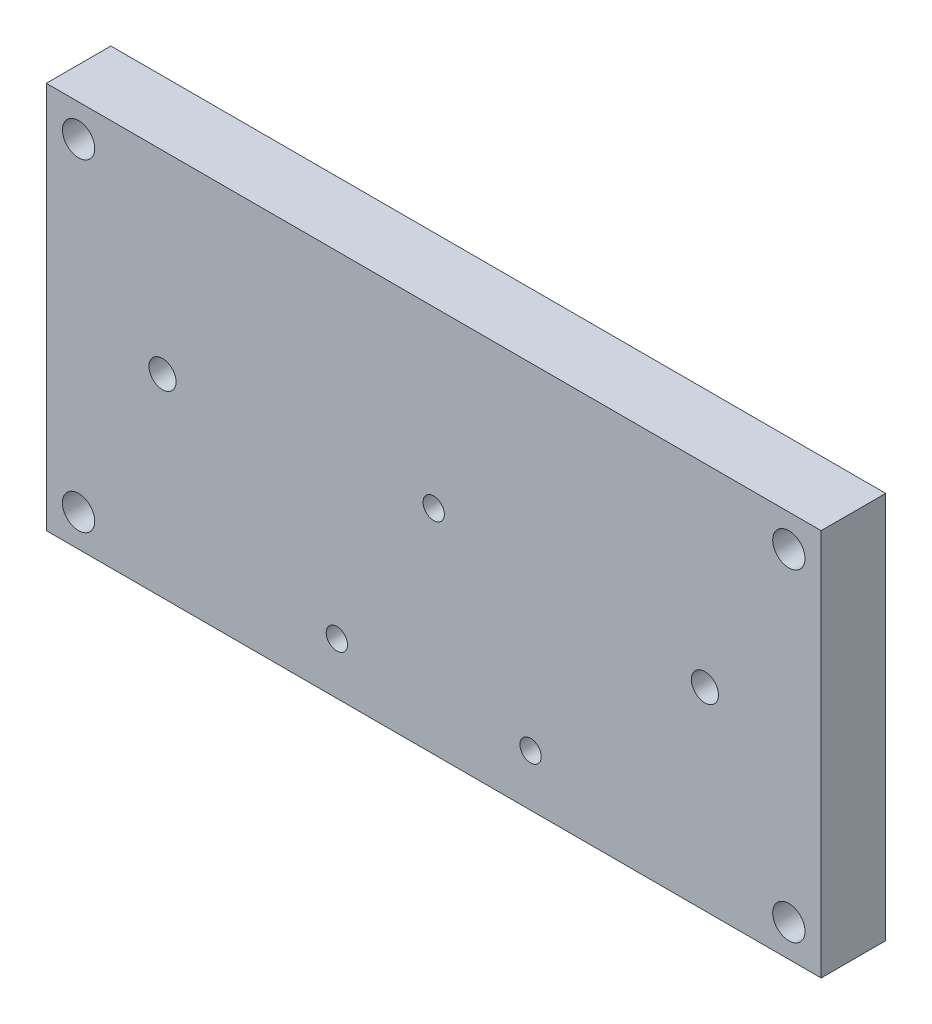
ISO-10303-21;
HEADER;
FILE_DESCRIPTION(('STEP AP214'),'2;1');
FILE_NAME('part.step','',(''),(''),'','','');
FILE_SCHEMA(('AUTOMOTIVE_DESIGN { 1 0 10303 214 1 1 1 1 }'));
ENDSEC;
DATA;
#1=APPLICATION_CONTEXT('core data for automotive mechanical design processes');
#2=APPLICATION_PROTOCOL_DEFINITION('international standard','automotive_design',2000,#1);
#3=PRODUCT_CONTEXT('',#1,'mechanical');
#4=PRODUCT('Part','Part','',(#3));
#5=PRODUCT_RELATED_PRODUCT_CATEGORY('part','',(#4));
#6=PRODUCT_DEFINITION_FORMATION('','',#4);
#7=PRODUCT_DEFINITION_CONTEXT('part definition',#1,'design');
#8=PRODUCT_DEFINITION('design','',#6,#7);
#9=PRODUCT_DEFINITION_SHAPE('','',#8);
#10=(LENGTH_UNIT() NAMED_UNIT(*) SI_UNIT(.MILLI.,.METRE.));
#11=(NAMED_UNIT(*) PLANE_ANGLE_UNIT() SI_UNIT($,.RADIAN.));
#12=(NAMED_UNIT(*) SI_UNIT($,.STERADIAN.) SOLID_ANGLE_UNIT());
#13=UNCERTAINTY_MEASURE_WITH_UNIT(LENGTH_MEASURE(1.E-05),#10,'distance_accuracy_value','');
#14=(GEOMETRIC_REPRESENTATION_CONTEXT(3) GLOBAL_UNCERTAINTY_ASSIGNED_CONTEXT((#13)) GLOBAL_UNIT_ASSIGNED_CONTEXT((#10,
#11,#12)) REPRESENTATION_CONTEXT('',''));
#15=CARTESIAN_POINT('',(0.,0.,0.));
#16=DIRECTION('',(0.,0.,1.));
#17=DIRECTION('',(1.,0.,0.));
#18=AXIS2_PLACEMENT_3D('',#15,#16,#17);
#19=CARTESIAN_POINT('',(60.,30.,10.));
#20=DIRECTION('',(-1.,0.,0.));
#21=DIRECTION('',(0.,-1.,0.));
#22=AXIS2_PLACEMENT_3D('',#19,#20,#21);
#23=PLANE('',#22);
#24=DIRECTION('',(0.,1.,0.));
#25=VECTOR('',#24,1.);
#26=CARTESIAN_POINT('',(60.,30.,0.));
#27=LINE('',#26,#25);
#28=CARTESIAN_POINT('',(60.,-30.,0.));
#29=VERTEX_POINT('',#28);
#30=CARTESIAN_POINT('',(60.,30.,0.));
#31=VERTEX_POINT('',#30);
#32=EDGE_CURVE('E100',#29,#31,#27,.T.);
#33=ORIENTED_EDGE('',*,*,#32,.T.);
#34=DIRECTION('',(0.,0.,-1.));
#35=VECTOR('',#34,1.);
#36=CARTESIAN_POINT('',(60.,30.,10.));
#37=LINE('',#36,#35);
#38=CARTESIAN_POINT('',(60.,30.,10.));
#39=VERTEX_POINT('',#38);
#40=EDGE_CURVE('E11',#39,#31,#37,.T.);
#41=ORIENTED_EDGE('',*,*,#40,.F.);
#42=DIRECTION('',(0.,1.,0.));
#43=VECTOR('',#42,1.);
#44=CARTESIAN_POINT('',(60.,30.,10.));
#45=LINE('',#44,#43);
#46=CARTESIAN_POINT('',(60.,-30.,10.));
#47=VERTEX_POINT('',#46);
#48=EDGE_CURVE('E88',#47,#39,#45,.T.);
#49=ORIENTED_EDGE('',*,*,#48,.F.);
#50=DIRECTION('',(0.,0.,-1.));
#51=VECTOR('',#50,1.);
#52=CARTESIAN_POINT('',(60.,-30.,10.));
#53=LINE('',#52,#51);
#54=EDGE_CURVE('E96',#47,#29,#53,.T.);
#55=ORIENTED_EDGE('',*,*,#54,.T.);
#56=EDGE_LOOP('',(#33,#41,#49,#55));
#57=FACE_BOUND('',#56,.T.);
#58=ADVANCED_FACE('F37',(#57),#23,.F.);
#59=CARTESIAN_POINT('',(-60.,30.,10.));
#60=DIRECTION('',(0.,-1.,0.));
#61=DIRECTION('',(0.,0.,-1.));
#62=AXIS2_PLACEMENT_3D('',#59,#60,#61);
#63=PLANE('',#62);
#64=DIRECTION('',(-1.,0.,0.));
#65=VECTOR('',#64,1.);
#66=CARTESIAN_POINT('',(-60.,30.,0.));
#67=LINE('',#66,#65);
#68=CARTESIAN_POINT('',(-60.,30.,0.));
#69=VERTEX_POINT('',#68);
#70=EDGE_CURVE('E92',#31,#69,#67,.T.);
#71=ORIENTED_EDGE('',*,*,#70,.T.);
#72=DIRECTION('',(0.,0.,-1.));
#73=VECTOR('',#72,1.);
#74=CARTESIAN_POINT('',(-60.,30.,10.));
#75=LINE('',#74,#73);
#76=CARTESIAN_POINT('',(-60.,30.,10.));
#77=VERTEX_POINT('',#76);
#78=EDGE_CURVE('E45',#77,#69,#75,.T.);
#79=ORIENTED_EDGE('',*,*,#78,.F.);
#80=DIRECTION('',(-1.,0.,0.));
#81=VECTOR('',#80,1.);
#82=CARTESIAN_POINT('',(-60.,30.,10.));
#83=LINE('',#82,#81);
#84=EDGE_CURVE('E83',#39,#77,#83,.T.);
#85=ORIENTED_EDGE('',*,*,#84,.F.);
#86=ORIENTED_EDGE('',*,*,#40,.T.);
#87=EDGE_LOOP('',(#71,#79,#85,#86));
#88=FACE_BOUND('',#87,.T.);
#89=ADVANCED_FACE('F91',(#88),#63,.F.);
#90=CARTESIAN_POINT('',(-60.,30.,10.));
#91=DIRECTION('',(1.,0.,0.));
#92=DIRECTION('',(0.,0.,-1.));
#93=AXIS2_PLACEMENT_3D('',#90,#91,#92);
#94=PLANE('',#93);
#95=DIRECTION('',(0.,-1.,0.));
#96=VECTOR('',#95,1.);
#97=CARTESIAN_POINT('',(-60.,30.,0.));
#98=LINE('',#97,#96);
#99=CARTESIAN_POINT('',(-60.,-30.,0.));
#100=VERTEX_POINT('',#99);
#101=EDGE_CURVE('E70',#69,#100,#98,.T.);
#102=ORIENTED_EDGE('',*,*,#101,.T.);
#103=DIRECTION('',(0.,0.,-1.));
#104=VECTOR('',#103,1.);
#105=CARTESIAN_POINT('',(-60.,-30.,10.));
#106=LINE('',#105,#104);
#107=CARTESIAN_POINT('',(-60.,-30.,10.));
#108=VERTEX_POINT('',#107);
#109=EDGE_CURVE('E93',#108,#100,#106,.T.);
#110=ORIENTED_EDGE('',*,*,#109,.F.);
#111=DIRECTION('',(0.,-1.,0.));
#112=VECTOR('',#111,1.);
#113=CARTESIAN_POINT('',(-60.,30.,10.));
#114=LINE('',#113,#112);
#115=EDGE_CURVE('E86',#77,#108,#114,.T.);
#116=ORIENTED_EDGE('',*,*,#115,.F.);
#117=ORIENTED_EDGE('',*,*,#78,.T.);
#118=EDGE_LOOP('',(#102,#110,#116,#117));
#119=FACE_BOUND('',#118,.T.);
#120=ADVANCED_FACE('F94',(#119),#94,.F.);
#121=CARTESIAN_POINT('',(-60.,-30.,10.));
#122=DIRECTION('',(0.,1.,0.));
#123=DIRECTION('',(0.,0.,1.));
#124=AXIS2_PLACEMENT_3D('',#121,#122,#123);
#125=PLANE('',#124);
#126=DIRECTION('',(1.,0.,0.));
#127=VECTOR('',#126,1.);
#128=CARTESIAN_POINT('',(-60.,-30.,0.));
#129=LINE('',#128,#127);
#130=EDGE_CURVE('E76',#100,#29,#129,.T.);
#131=ORIENTED_EDGE('',*,*,#130,.T.);
#132=ORIENTED_EDGE('',*,*,#54,.F.);
#133=DIRECTION('',(1.,0.,0.));
#134=VECTOR('',#133,1.);
#135=CARTESIAN_POINT('',(-60.,-30.,10.));
#136=LINE('',#135,#134);
#137=EDGE_CURVE('E53',#108,#47,#136,.T.);
#138=ORIENTED_EDGE('',*,*,#137,.F.);
#139=ORIENTED_EDGE('',*,*,#109,.T.);
#140=EDGE_LOOP('',(#131,#132,#138,#139));
#141=FACE_BOUND('',#140,.T.);
#142=ADVANCED_FACE('F108',(#141),#125,.F.);
#143=CARTESIAN_POINT('',(0.,0.,10.));
#144=DIRECTION('',(0.,0.,1.));
#145=DIRECTION('',(1.,0.,0.));
#146=AXIS2_PLACEMENT_3D('',#143,#144,#145);
#147=PLANE('',#146);
#148=CARTESIAN_POINT('',(0.,3.,10.));
#149=DIRECTION('',(0.,0.,1.));
#150=DIRECTION('',(1.,0.,0.));
#151=AXIS2_PLACEMENT_3D('',#148,#149,#150);
#152=CIRCLE('',#151,1.65);
#153=CARTESIAN_POINT('',(1.65,3.,10.));
#154=VERTEX_POINT('',#153);
#155=EDGE_CURVE('E164',#154,#154,#152,.T.);
#156=ORIENTED_EDGE('',*,*,#155,.F.);
#157=EDGE_LOOP('',(#156));
#158=FACE_BOUND('',#157,.T.);
#159=CARTESIAN_POINT('',(-15.,-22.,10.));
#160=DIRECTION('',(0.,0.,1.));
#161=DIRECTION('',(1.,0.,0.));
#162=AXIS2_PLACEMENT_3D('',#159,#160,#161);
#163=CIRCLE('',#162,1.65);
#164=CARTESIAN_POINT('',(-13.35,-22.,10.));
#165=VERTEX_POINT('',#164);
#166=EDGE_CURVE('E158',#165,#165,#163,.T.);
#167=ORIENTED_EDGE('',*,*,#166,.F.);
#168=EDGE_LOOP('',(#167));
#169=FACE_BOUND('',#168,.T.);
#170=CARTESIAN_POINT('',(15.,-22.,10.));
#171=DIRECTION('',(0.,0.,1.));
#172=DIRECTION('',(1.,0.,0.));
#173=AXIS2_PLACEMENT_3D('',#170,#171,#172);
#174=CIRCLE('',#173,1.65);
#175=CARTESIAN_POINT('',(16.65,-22.,10.));
#176=VERTEX_POINT('',#175);
#177=EDGE_CURVE('E152',#176,#176,#174,.T.);
#178=ORIENTED_EDGE('',*,*,#177,.F.);
#179=EDGE_LOOP('',(#178));
#180=FACE_BOUND('',#179,.T.);
#181=CARTESIAN_POINT('',(-42.,0.,10.));
#182=DIRECTION('',(0.,0.,1.));
#183=DIRECTION('',(1.,0.,0.));
#184=AXIS2_PLACEMENT_3D('',#181,#182,#183);
#185=CIRCLE('',#184,2.09999999999999);
#186=CARTESIAN_POINT('',(-39.9,0.,10.));
#187=VERTEX_POINT('',#186);
#188=EDGE_CURVE('E146',#187,#187,#185,.T.);
#189=ORIENTED_EDGE('',*,*,#188,.F.);
#190=EDGE_LOOP('',(#189));
#191=FACE_BOUND('',#190,.T.);
#192=CARTESIAN_POINT('',(42.,0.,10.));
#193=DIRECTION('',(0.,0.,1.));
#194=DIRECTION('',(1.,0.,0.));
#195=AXIS2_PLACEMENT_3D('',#192,#193,#194);
#196=CIRCLE('',#195,2.09999999999999);
#197=CARTESIAN_POINT('',(44.1,0.,10.));
#198=VERTEX_POINT('',#197);
#199=EDGE_CURVE('E140',#198,#198,#196,.T.);
#200=ORIENTED_EDGE('',*,*,#199,.F.);
#201=EDGE_LOOP('',(#200));
#202=FACE_BOUND('',#201,.T.);
#203=CARTESIAN_POINT('',(-55.,-25.,10.));
#204=DIRECTION('',(0.,0.,1.));
#205=DIRECTION('',(1.,0.,0.));
#206=AXIS2_PLACEMENT_3D('',#203,#204,#205);
#207=CIRCLE('',#206,2.49999999999999);
#208=CARTESIAN_POINT('',(-52.5,-25.,10.));
#209=VERTEX_POINT('',#208);
#210=EDGE_CURVE('E134',#209,#209,#207,.T.);
#211=ORIENTED_EDGE('',*,*,#210,.F.);
#212=EDGE_LOOP('',(#211));
#213=FACE_BOUND('',#212,.T.);
#214=CARTESIAN_POINT('',(-55.,25.,10.));
#215=DIRECTION('',(0.,0.,1.));
#216=DIRECTION('',(1.,0.,0.));
#217=AXIS2_PLACEMENT_3D('',#214,#215,#216);
#218=CIRCLE('',#217,2.49999999999999);
#219=CARTESIAN_POINT('',(-52.5,25.,10.));
#220=VERTEX_POINT('',#219);
#221=EDGE_CURVE('E128',#220,#220,#218,.T.);
#222=ORIENTED_EDGE('',*,*,#221,.F.);
#223=EDGE_LOOP('',(#222));
#224=FACE_BOUND('',#223,.T.);
#225=CARTESIAN_POINT('',(55.,25.,10.));
#226=DIRECTION('',(0.,0.,1.));
#227=DIRECTION('',(1.,0.,0.));
#228=AXIS2_PLACEMENT_3D('',#225,#226,#227);
#229=CIRCLE('',#228,2.49999999999999);
#230=CARTESIAN_POINT('',(57.5,25.,10.));
#231=VERTEX_POINT('',#230);
#232=EDGE_CURVE('E122',#231,#231,#229,.T.);
#233=ORIENTED_EDGE('',*,*,#232,.F.);
#234=EDGE_LOOP('',(#233));
#235=FACE_BOUND('',#234,.T.);
#236=CARTESIAN_POINT('',(55.,-25.,10.));
#237=DIRECTION('',(0.,0.,1.));
#238=DIRECTION('',(1.,0.,0.));
#239=AXIS2_PLACEMENT_3D('',#236,#237,#238);
#240=CIRCLE('',#239,2.49999999999999);
#241=CARTESIAN_POINT('',(57.5,-25.,10.));
#242=VERTEX_POINT('',#241);
#243=EDGE_CURVE('E116',#242,#242,#240,.T.);
#244=ORIENTED_EDGE('',*,*,#243,.F.);
#245=EDGE_LOOP('',(#244));
#246=FACE_BOUND('',#245,.T.);
#247=ORIENTED_EDGE('',*,*,#48,.T.);
#248=ORIENTED_EDGE('',*,*,#84,.T.);
#249=ORIENTED_EDGE('',*,*,#115,.T.);
#250=ORIENTED_EDGE('',*,*,#137,.T.);
#251=EDGE_LOOP('',(#247,#248,#249,#250));
#252=FACE_BOUND('',#251,.T.);
#253=ADVANCED_FACE('F84',(#158,#169,#180,#191,#202,#213,#224,#235,#246,#252),#147,.T.);
#254=CARTESIAN_POINT('',(0.,0.,0.));
#255=DIRECTION('',(0.,0.,1.));
#256=DIRECTION('',(1.,0.,0.));
#257=AXIS2_PLACEMENT_3D('',#254,#255,#256);
#258=PLANE('',#257);
#259=CARTESIAN_POINT('',(0.,3.,0.));
#260=DIRECTION('',(0.,0.,1.));
#261=DIRECTION('',(1.,0.,0.));
#262=AXIS2_PLACEMENT_3D('',#259,#260,#261);
#263=CIRCLE('',#262,1.65);
#264=CARTESIAN_POINT('',(1.65,3.,0.));
#265=VERTEX_POINT('',#264);
#266=EDGE_CURVE('E161',#265,#265,#263,.T.);
#267=ORIENTED_EDGE('',*,*,#266,.T.);
#268=EDGE_LOOP('',(#267));
#269=FACE_BOUND('',#268,.T.);
#270=CARTESIAN_POINT('',(-15.,-22.,0.));
#271=DIRECTION('',(0.,0.,1.));
#272=DIRECTION('',(1.,0.,0.));
#273=AXIS2_PLACEMENT_3D('',#270,#271,#272);
#274=CIRCLE('',#273,1.65);
#275=CARTESIAN_POINT('',(-13.35,-22.,0.));
#276=VERTEX_POINT('',#275);
#277=EDGE_CURVE('E155',#276,#276,#274,.T.);
#278=ORIENTED_EDGE('',*,*,#277,.T.);
#279=EDGE_LOOP('',(#278));
#280=FACE_BOUND('',#279,.T.);
#281=CARTESIAN_POINT('',(15.,-22.,0.));
#282=DIRECTION('',(0.,0.,1.));
#283=DIRECTION('',(1.,0.,0.));
#284=AXIS2_PLACEMENT_3D('',#281,#282,#283);
#285=CIRCLE('',#284,1.65);
#286=CARTESIAN_POINT('',(16.65,-22.,0.));
#287=VERTEX_POINT('',#286);
#288=EDGE_CURVE('E149',#287,#287,#285,.T.);
#289=ORIENTED_EDGE('',*,*,#288,.T.);
#290=EDGE_LOOP('',(#289));
#291=FACE_BOUND('',#290,.T.);
#292=CARTESIAN_POINT('',(-42.,0.,0.));
#293=DIRECTION('',(0.,0.,1.));
#294=DIRECTION('',(1.,0.,0.));
#295=AXIS2_PLACEMENT_3D('',#292,#293,#294);
#296=CIRCLE('',#295,2.1);
#297=CARTESIAN_POINT('',(-39.9,0.,0.));
#298=VERTEX_POINT('',#297);
#299=EDGE_CURVE('E143',#298,#298,#296,.T.);
#300=ORIENTED_EDGE('',*,*,#299,.T.);
#301=EDGE_LOOP('',(#300));
#302=FACE_BOUND('',#301,.T.);
#303=CARTESIAN_POINT('',(42.,0.,0.));
#304=DIRECTION('',(0.,0.,1.));
#305=DIRECTION('',(1.,0.,0.));
#306=AXIS2_PLACEMENT_3D('',#303,#304,#305);
#307=CIRCLE('',#306,2.1);
#308=CARTESIAN_POINT('',(44.1,0.,0.));
#309=VERTEX_POINT('',#308);
#310=EDGE_CURVE('E137',#309,#309,#307,.T.);
#311=ORIENTED_EDGE('',*,*,#310,.T.);
#312=EDGE_LOOP('',(#311));
#313=FACE_BOUND('',#312,.T.);
#314=CARTESIAN_POINT('',(-55.,-25.,0.));
#315=DIRECTION('',(0.,0.,1.));
#316=DIRECTION('',(1.,0.,0.));
#317=AXIS2_PLACEMENT_3D('',#314,#315,#316);
#318=CIRCLE('',#317,2.5);
#319=CARTESIAN_POINT('',(-52.5,-25.,0.));
#320=VERTEX_POINT('',#319);
#321=EDGE_CURVE('E131',#320,#320,#318,.T.);
#322=ORIENTED_EDGE('',*,*,#321,.T.);
#323=EDGE_LOOP('',(#322));
#324=FACE_BOUND('',#323,.T.);
#325=CARTESIAN_POINT('',(-55.,25.,0.));
#326=DIRECTION('',(0.,0.,1.));
#327=DIRECTION('',(1.,0.,0.));
#328=AXIS2_PLACEMENT_3D('',#325,#326,#327);
#329=CIRCLE('',#328,2.5);
#330=CARTESIAN_POINT('',(-52.5,25.,0.));
#331=VERTEX_POINT('',#330);
#332=EDGE_CURVE('E125',#331,#331,#329,.T.);
#333=ORIENTED_EDGE('',*,*,#332,.T.);
#334=EDGE_LOOP('',(#333));
#335=FACE_BOUND('',#334,.T.);
#336=CARTESIAN_POINT('',(55.,25.,0.));
#337=DIRECTION('',(0.,0.,1.));
#338=DIRECTION('',(1.,0.,0.));
#339=AXIS2_PLACEMENT_3D('',#336,#337,#338);
#340=CIRCLE('',#339,2.5);
#341=CARTESIAN_POINT('',(57.5,25.,0.));
#342=VERTEX_POINT('',#341);
#343=EDGE_CURVE('E119',#342,#342,#340,.T.);
#344=ORIENTED_EDGE('',*,*,#343,.T.);
#345=EDGE_LOOP('',(#344));
#346=FACE_BOUND('',#345,.T.);
#347=CARTESIAN_POINT('',(55.,-25.,0.));
#348=DIRECTION('',(0.,0.,1.));
#349=DIRECTION('',(1.,0.,0.));
#350=AXIS2_PLACEMENT_3D('',#347,#348,#349);
#351=CIRCLE('',#350,2.5);
#352=CARTESIAN_POINT('',(57.5,-25.,0.));
#353=VERTEX_POINT('',#352);
#354=EDGE_CURVE('E103',#353,#353,#351,.T.);
#355=ORIENTED_EDGE('',*,*,#354,.T.);
#356=EDGE_LOOP('',(#355));
#357=FACE_BOUND('',#356,.T.);
#358=ORIENTED_EDGE('',*,*,#32,.F.);
#359=ORIENTED_EDGE('',*,*,#130,.F.);
#360=ORIENTED_EDGE('',*,*,#101,.F.);
#361=ORIENTED_EDGE('',*,*,#70,.F.);
#362=EDGE_LOOP('',(#358,#359,#360,#361));
#363=FACE_BOUND('',#362,.T.);
#364=ADVANCED_FACE('F111',(#269,#280,#291,#302,#313,#324,#335,#346,#357,#363),#258,.F.);
#365=CARTESIAN_POINT('',(55.,-25.,10.));
#366=DIRECTION('',(0.,0.,1.));
#367=DIRECTION('',(1.,0.,0.));
#368=AXIS2_PLACEMENT_3D('',#365,#366,#367);
#369=CYLINDRICAL_SURFACE('',#368,2.49999999999999);
#370=ORIENTED_EDGE('',*,*,#354,.F.);
#371=EDGE_LOOP('',(#370));
#372=FACE_BOUND('',#371,.T.);
#373=ORIENTED_EDGE('',*,*,#243,.T.);
#374=EDGE_LOOP('',(#373));
#375=FACE_BOUND('',#374,.T.);
#376=ADVANCED_FACE('F189',(#372,#375),#369,.F.);
#377=CARTESIAN_POINT('',(55.,25.,10.));
#378=DIRECTION('',(0.,0.,1.));
#379=DIRECTION('',(1.,0.,0.));
#380=AXIS2_PLACEMENT_3D('',#377,#378,#379);
#381=CYLINDRICAL_SURFACE('',#380,2.49999999999999);
#382=ORIENTED_EDGE('',*,*,#343,.F.);
#383=EDGE_LOOP('',(#382));
#384=FACE_BOUND('',#383,.T.);
#385=ORIENTED_EDGE('',*,*,#232,.T.);
#386=EDGE_LOOP('',(#385));
#387=FACE_BOUND('',#386,.T.);
#388=ADVANCED_FACE('F191',(#384,#387),#381,.F.);
#389=CARTESIAN_POINT('',(-55.,25.,10.));
#390=DIRECTION('',(0.,0.,1.));
#391=DIRECTION('',(1.,0.,0.));
#392=AXIS2_PLACEMENT_3D('',#389,#390,#391);
#393=CYLINDRICAL_SURFACE('',#392,2.49999999999999);
#394=ORIENTED_EDGE('',*,*,#332,.F.);
#395=EDGE_LOOP('',(#394));
#396=FACE_BOUND('',#395,.T.);
#397=ORIENTED_EDGE('',*,*,#221,.T.);
#398=EDGE_LOOP('',(#397));
#399=FACE_BOUND('',#398,.T.);
#400=ADVANCED_FACE('F198',(#396,#399),#393,.F.);
#401=CARTESIAN_POINT('',(-55.,-25.,10.));
#402=DIRECTION('',(0.,0.,1.));
#403=DIRECTION('',(1.,0.,0.));
#404=AXIS2_PLACEMENT_3D('',#401,#402,#403);
#405=CYLINDRICAL_SURFACE('',#404,2.49999999999999);
#406=ORIENTED_EDGE('',*,*,#321,.F.);
#407=EDGE_LOOP('',(#406));
#408=FACE_BOUND('',#407,.T.);
#409=ORIENTED_EDGE('',*,*,#210,.T.);
#410=EDGE_LOOP('',(#409));
#411=FACE_BOUND('',#410,.T.);
#412=ADVANCED_FACE('F296',(#408,#411),#405,.F.);
#413=CARTESIAN_POINT('',(42.,0.,10.));
#414=DIRECTION('',(0.,0.,1.));
#415=DIRECTION('',(1.,0.,0.));
#416=AXIS2_PLACEMENT_3D('',#413,#414,#415);
#417=CYLINDRICAL_SURFACE('',#416,2.09999999999999);
#418=ORIENTED_EDGE('',*,*,#310,.F.);
#419=EDGE_LOOP('',(#418));
#420=FACE_BOUND('',#419,.T.);
#421=ORIENTED_EDGE('',*,*,#199,.T.);
#422=EDGE_LOOP('',(#421));
#423=FACE_BOUND('',#422,.T.);
#424=ADVANCED_FACE('F291',(#420,#423),#417,.F.);
#425=CARTESIAN_POINT('',(-42.,0.,10.));
#426=DIRECTION('',(0.,0.,1.));
#427=DIRECTION('',(1.,0.,0.));
#428=AXIS2_PLACEMENT_3D('',#425,#426,#427);
#429=CYLINDRICAL_SURFACE('',#428,2.09999999999999);
#430=ORIENTED_EDGE('',*,*,#299,.F.);
#431=EDGE_LOOP('',(#430));
#432=FACE_BOUND('',#431,.T.);
#433=ORIENTED_EDGE('',*,*,#188,.T.);
#434=EDGE_LOOP('',(#433));
#435=FACE_BOUND('',#434,.T.);
#436=ADVANCED_FACE('F247',(#432,#435),#429,.F.);
#437=CARTESIAN_POINT('',(15.,-22.,10.));
#438=DIRECTION('',(0.,0.,1.));
#439=DIRECTION('',(1.,0.,0.));
#440=AXIS2_PLACEMENT_3D('',#437,#438,#439);
#441=CYLINDRICAL_SURFACE('',#440,1.65);
#442=ORIENTED_EDGE('',*,*,#288,.F.);
#443=EDGE_LOOP('',(#442));
#444=FACE_BOUND('',#443,.T.);
#445=ORIENTED_EDGE('',*,*,#177,.T.);
#446=EDGE_LOOP('',(#445));
#447=FACE_BOUND('',#446,.T.);
#448=ADVANCED_FACE('F240',(#444,#447),#441,.F.);
#449=CARTESIAN_POINT('',(-15.,-22.,10.));
#450=DIRECTION('',(0.,0.,1.));
#451=DIRECTION('',(1.,0.,0.));
#452=AXIS2_PLACEMENT_3D('',#449,#450,#451);
#453=CYLINDRICAL_SURFACE('',#452,1.65);
#454=ORIENTED_EDGE('',*,*,#277,.F.);
#455=EDGE_LOOP('',(#454));
#456=FACE_BOUND('',#455,.T.);
#457=ORIENTED_EDGE('',*,*,#166,.T.);
#458=EDGE_LOOP('',(#457));
#459=FACE_BOUND('',#458,.T.);
#460=ADVANCED_FACE('F246',(#456,#459),#453,.F.);
#461=CARTESIAN_POINT('',(0.,3.,10.));
#462=DIRECTION('',(0.,0.,1.));
#463=DIRECTION('',(1.,0.,0.));
#464=AXIS2_PLACEMENT_3D('',#461,#462,#463);
#465=CYLINDRICAL_SURFACE('',#464,1.65);
#466=ORIENTED_EDGE('',*,*,#266,.F.);
#467=EDGE_LOOP('',(#466));
#468=FACE_BOUND('',#467,.T.);
#469=ORIENTED_EDGE('',*,*,#155,.T.);
#470=EDGE_LOOP('',(#469));
#471=FACE_BOUND('',#470,.T.);
#472=ADVANCED_FACE('F168',(#468,#471),#465,.F.);
#473=CLOSED_SHELL('',(#58,#89,#120,#142,#253,#364,#376,#388,#400,#412,#424,#436,#448,#460,#472));
#474=MANIFOLD_SOLID_BREP('B2',#473);
#475=ADVANCED_BREP_SHAPE_REPRESENTATION('',(#18,#474),#14);
#476=SHAPE_DEFINITION_REPRESENTATION(#9,#475);
ENDSEC;
END-ISO-10303-21;
